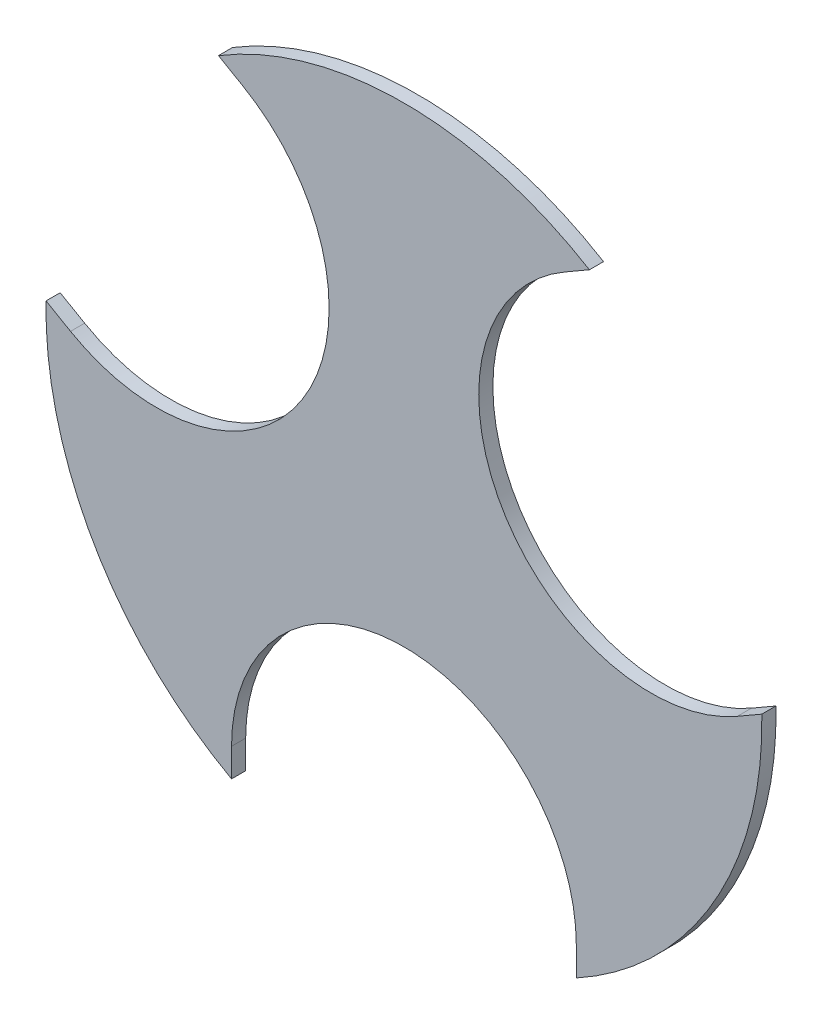
ISO-10303-21;
HEADER;
FILE_DESCRIPTION(('STEP AP214'),'2;1');
FILE_NAME('part.step','',(''),(''),'','','');
FILE_SCHEMA(('AUTOMOTIVE_DESIGN { 1 0 10303 214 1 1 1 1 }'));
ENDSEC;
DATA;
#1=APPLICATION_CONTEXT('core data for automotive mechanical design processes');
#2=APPLICATION_PROTOCOL_DEFINITION('international standard','automotive_design',2000,#1);
#3=PRODUCT_CONTEXT('',#1,'mechanical');
#4=PRODUCT('Part','Part','',(#3));
#5=PRODUCT_RELATED_PRODUCT_CATEGORY('part','',(#4));
#6=PRODUCT_DEFINITION_FORMATION('','',#4);
#7=PRODUCT_DEFINITION_CONTEXT('part definition',#1,'design');
#8=PRODUCT_DEFINITION('design','',#6,#7);
#9=PRODUCT_DEFINITION_SHAPE('','',#8);
#10=(LENGTH_UNIT() NAMED_UNIT(*) SI_UNIT(.MILLI.,.METRE.));
#11=(NAMED_UNIT(*) PLANE_ANGLE_UNIT() SI_UNIT($,.RADIAN.));
#12=(NAMED_UNIT(*) SI_UNIT($,.STERADIAN.) SOLID_ANGLE_UNIT());
#13=UNCERTAINTY_MEASURE_WITH_UNIT(LENGTH_MEASURE(1.E-05),#10,'distance_accuracy_value','');
#14=(GEOMETRIC_REPRESENTATION_CONTEXT(3) GLOBAL_UNCERTAINTY_ASSIGNED_CONTEXT((#13)) GLOBAL_UNIT_ASSIGNED_CONTEXT((#10,
#11,#12)) REPRESENTATION_CONTEXT('',''));
#15=CARTESIAN_POINT('',(0.,0.,0.));
#16=DIRECTION('',(0.,0.,1.));
#17=DIRECTION('',(1.,0.,0.));
#18=AXIS2_PLACEMENT_3D('',#15,#16,#17);
#19=CARTESIAN_POINT('',(0.,0.,5.));
#20=DIRECTION('',(0.,0.,-1.));
#21=DIRECTION('',(-1.,0.,0.));
#22=AXIS2_PLACEMENT_3D('',#19,#20,#21);
#23=CYLINDRICAL_SURFACE('',#22,126.65701717631);
#24=CARTESIAN_POINT('',(0.,0.,0.));
#25=DIRECTION('',(0.,0.,1.));
#26=DIRECTION('',(1.,0.,0.));
#27=AXIS2_PLACEMENT_3D('',#24,#25,#26);
#28=CIRCLE('',#27,126.65701717631);
#29=CARTESIAN_POINT('',(65.6288198200727,108.327549630851,0.));
#30=VERTEX_POINT('',#29);
#31=CARTESIAN_POINT('',(-65.6288198200727,108.327549630851,0.));
#32=VERTEX_POINT('',#31);
#33=EDGE_CURVE('E153',#30,#32,#28,.T.);
#34=ORIENTED_EDGE('',*,*,#33,.T.);
#35=DIRECTION('',(0.,0.,-1.));
#36=VECTOR('',#35,1.);
#37=CARTESIAN_POINT('',(-65.6288198200727,108.327549630851,5.));
#38=LINE('',#37,#36);
#39=CARTESIAN_POINT('',(-65.6288198200727,108.327549630851,5.));
#40=VERTEX_POINT('',#39);
#41=EDGE_CURVE('E11',#40,#32,#38,.T.);
#42=ORIENTED_EDGE('',*,*,#41,.F.);
#43=CARTESIAN_POINT('',(0.,0.,5.));
#44=DIRECTION('',(0.,0.,1.));
#45=DIRECTION('',(1.,0.,0.));
#46=AXIS2_PLACEMENT_3D('',#43,#44,#45);
#47=CIRCLE('',#46,126.65701717631);
#48=CARTESIAN_POINT('',(65.6288198200727,108.327549630851,5.));
#49=VERTEX_POINT('',#48);
#50=EDGE_CURVE('E175',#49,#40,#47,.T.);
#51=ORIENTED_EDGE('',*,*,#50,.F.);
#52=DIRECTION('',(0.,0.,-1.));
#53=VECTOR('',#52,1.);
#54=CARTESIAN_POINT('',(65.6288198200727,108.327549630851,5.));
#55=LINE('',#54,#53);
#56=EDGE_CURVE('E149',#49,#30,#55,.T.);
#57=ORIENTED_EDGE('',*,*,#56,.T.);
#58=EDGE_LOOP('',(#34,#42,#51,#57));
#59=FACE_BOUND('',#58,.T.);
#60=ADVANCED_FACE('F33',(#59),#23,.T.);
#61=CARTESIAN_POINT('',(-65.6288198200727,108.327549630851,5.));
#62=DIRECTION('',(0.5,0.866025403784439,0.));
#63=DIRECTION('',(-0.866025403784439,0.5,0.));
#64=AXIS2_PLACEMENT_3D('',#61,#62,#63);
#65=PLANE('',#64);
#66=DIRECTION('',(0.866025403784439,-0.5,0.));
#67=VECTOR('',#66,1.);
#68=CARTESIAN_POINT('',(-65.6288198200727,108.327549630851,0.));
#69=LINE('',#68,#67);
#70=CARTESIAN_POINT('',(-56.9685657822284,103.327549630851,0.));
#71=VERTEX_POINT('',#70);
#72=EDGE_CURVE('E156',#32,#71,#69,.T.);
#73=ORIENTED_EDGE('',*,*,#72,.T.);
#74=DIRECTION('',(0.,0.,-1.));
#75=VECTOR('',#74,1.);
#76=CARTESIAN_POINT('',(-56.9685657822284,103.327549630851,5.));
#77=LINE('',#76,#75);
#78=CARTESIAN_POINT('',(-56.9685657822284,103.327549630851,5.));
#79=VERTEX_POINT('',#78);
#80=EDGE_CURVE('E41',#79,#71,#77,.T.);
#81=ORIENTED_EDGE('',*,*,#80,.F.);
#82=DIRECTION('',(0.866025403784439,-0.5,0.));
#83=VECTOR('',#82,1.);
#84=CARTESIAN_POINT('',(-65.6288198200727,108.327549630851,5.));
#85=LINE('',#84,#83);
#86=EDGE_CURVE('E104',#40,#79,#85,.T.);
#87=ORIENTED_EDGE('',*,*,#86,.F.);
#88=ORIENTED_EDGE('',*,*,#41,.T.);
#89=EDGE_LOOP('',(#73,#81,#87,#88));
#90=FACE_BOUND('',#89,.T.);
#91=ADVANCED_FACE('F253',(#90),#65,.F.);
#92=CARTESIAN_POINT('',(-87.4685657822283,50.5,5.));
#93=DIRECTION('',(0.,0.,-1.));
#94=DIRECTION('',(-1.,0.,0.));
#95=AXIS2_PLACEMENT_3D('',#92,#93,#94);
#96=CYLINDRICAL_SURFACE('',#95,60.9999999999999);
#97=CARTESIAN_POINT('',(-87.4685657822283,50.5,0.));
#98=DIRECTION('',(0.,0.,-1.));
#99=DIRECTION('',(1.,0.,0.));
#100=AXIS2_PLACEMENT_3D('',#97,#98,#99);
#101=CIRCLE('',#100,60.9999999999999);
#102=CARTESIAN_POINT('',(-117.968565782228,-2.3275496308507,0.));
#103=VERTEX_POINT('',#102);
#104=EDGE_CURVE('E158',#71,#103,#101,.T.);
#105=ORIENTED_EDGE('',*,*,#104,.T.);
#106=DIRECTION('',(0.,0.,-1.));
#107=VECTOR('',#106,1.);
#108=CARTESIAN_POINT('',(-117.968565782228,-2.3275496308507,5.));
#109=LINE('',#108,#107);
#110=CARTESIAN_POINT('',(-117.968565782228,-2.3275496308507,5.));
#111=VERTEX_POINT('',#110);
#112=EDGE_CURVE('E194',#111,#103,#109,.T.);
#113=ORIENTED_EDGE('',*,*,#112,.F.);
#114=CARTESIAN_POINT('',(-87.4685657822283,50.5,5.));
#115=DIRECTION('',(0.,0.,-1.));
#116=DIRECTION('',(1.,0.,0.));
#117=AXIS2_PLACEMENT_3D('',#114,#115,#116);
#118=CIRCLE('',#117,60.9999999999999);
#119=EDGE_CURVE('E202',#79,#111,#118,.T.);
#120=ORIENTED_EDGE('',*,*,#119,.F.);
#121=ORIENTED_EDGE('',*,*,#80,.T.);
#122=EDGE_LOOP('',(#105,#113,#120,#121));
#123=FACE_BOUND('',#122,.T.);
#124=ADVANCED_FACE('F200',(#123),#96,.F.);
#125=CARTESIAN_POINT('',(-126.628819820073,2.67245036914929,5.));
#126=DIRECTION('',(-0.5,-0.866025403784438,0.));
#127=DIRECTION('',(0.866025403784438,-0.500000000000001,0.));
#128=AXIS2_PLACEMENT_3D('',#125,#126,#127);
#129=PLANE('',#128);
#130=DIRECTION('',(-0.866025403784438,0.5,0.));
#131=VECTOR('',#130,1.);
#132=CARTESIAN_POINT('',(-126.628819820073,2.67245036914929,0.));
#133=LINE('',#132,#131);
#134=CARTESIAN_POINT('',(-126.628819820073,2.67245036914929,0.));
#135=VERTEX_POINT('',#134);
#136=EDGE_CURVE('E160',#103,#135,#133,.T.);
#137=ORIENTED_EDGE('',*,*,#136,.T.);
#138=DIRECTION('',(0.,0.,-1.));
#139=VECTOR('',#138,1.);
#140=CARTESIAN_POINT('',(-126.628819820073,2.67245036914929,5.));
#141=LINE('',#140,#139);
#142=CARTESIAN_POINT('',(-126.628819820073,2.67245036914929,5.));
#143=VERTEX_POINT('',#142);
#144=EDGE_CURVE('E191',#143,#135,#141,.T.);
#145=ORIENTED_EDGE('',*,*,#144,.F.);
#146=DIRECTION('',(-0.866025403784438,0.5,0.));
#147=VECTOR('',#146,1.);
#148=CARTESIAN_POINT('',(-126.628819820073,2.67245036914929,5.));
#149=LINE('',#148,#147);
#150=EDGE_CURVE('E220',#111,#143,#149,.T.);
#151=ORIENTED_EDGE('',*,*,#150,.F.);
#152=ORIENTED_EDGE('',*,*,#112,.T.);
#153=EDGE_LOOP('',(#137,#145,#151,#152));
#154=FACE_BOUND('',#153,.T.);
#155=ADVANCED_FACE('F211',(#154),#129,.F.);
#156=CARTESIAN_POINT('',(0.,0.,5.));
#157=DIRECTION('',(0.,0.,-1.));
#158=DIRECTION('',(-1.,0.,0.));
#159=AXIS2_PLACEMENT_3D('',#156,#157,#158);
#160=CYLINDRICAL_SURFACE('',#159,126.65701717631);
#161=CARTESIAN_POINT('',(0.,0.,0.));
#162=DIRECTION('',(0.,0.,1.));
#163=DIRECTION('',(1.,0.,0.));
#164=AXIS2_PLACEMENT_3D('',#161,#162,#163);
#165=CIRCLE('',#164,126.65701717631);
#166=CARTESIAN_POINT('',(-60.9999999999999,-111.,0.));
#167=VERTEX_POINT('',#166);
#168=EDGE_CURVE('E162',#135,#167,#165,.T.);
#169=ORIENTED_EDGE('',*,*,#168,.T.);
#170=DIRECTION('',(0.,0.,-1.));
#171=VECTOR('',#170,1.);
#172=CARTESIAN_POINT('',(-60.9999999999999,-111.,5.));
#173=LINE('',#172,#171);
#174=CARTESIAN_POINT('',(-60.9999999999999,-111.,5.));
#175=VERTEX_POINT('',#174);
#176=EDGE_CURVE('E188',#175,#167,#173,.T.);
#177=ORIENTED_EDGE('',*,*,#176,.F.);
#178=CARTESIAN_POINT('',(0.,0.,5.));
#179=DIRECTION('',(0.,0.,1.));
#180=DIRECTION('',(1.,0.,0.));
#181=AXIS2_PLACEMENT_3D('',#178,#179,#180);
#182=CIRCLE('',#181,126.65701717631);
#183=EDGE_CURVE('E217',#143,#175,#182,.T.);
#184=ORIENTED_EDGE('',*,*,#183,.F.);
#185=ORIENTED_EDGE('',*,*,#144,.T.);
#186=EDGE_LOOP('',(#169,#177,#184,#185));
#187=FACE_BOUND('',#186,.T.);
#188=ADVANCED_FACE('F215',(#187),#160,.T.);
#189=CARTESIAN_POINT('',(-60.9999999999999,-101.,5.));
#190=DIRECTION('',(-1.,0.,0.));
#191=DIRECTION('',(0.,0.,1.));
#192=AXIS2_PLACEMENT_3D('',#189,#190,#191);
#193=PLANE('',#192);
#194=DIRECTION('',(0.,1.,0.));
#195=VECTOR('',#194,1.);
#196=CARTESIAN_POINT('',(-60.9999999999999,-101.,0.));
#197=LINE('',#196,#195);
#198=CARTESIAN_POINT('',(-60.9999999999999,-101.,0.));
#199=VERTEX_POINT('',#198);
#200=EDGE_CURVE('E164',#167,#199,#197,.T.);
#201=ORIENTED_EDGE('',*,*,#200,.T.);
#202=DIRECTION('',(0.,0.,-1.));
#203=VECTOR('',#202,1.);
#204=CARTESIAN_POINT('',(-60.9999999999999,-101.,5.));
#205=LINE('',#204,#203);
#206=CARTESIAN_POINT('',(-60.9999999999999,-101.,5.));
#207=VERTEX_POINT('',#206);
#208=EDGE_CURVE('E185',#207,#199,#205,.T.);
#209=ORIENTED_EDGE('',*,*,#208,.F.);
#210=DIRECTION('',(0.,1.,0.));
#211=VECTOR('',#210,1.);
#212=CARTESIAN_POINT('',(-60.9999999999999,-101.,5.));
#213=LINE('',#212,#211);
#214=EDGE_CURVE('E219',#175,#207,#213,.T.);
#215=ORIENTED_EDGE('',*,*,#214,.F.);
#216=ORIENTED_EDGE('',*,*,#176,.T.);
#217=EDGE_LOOP('',(#201,#209,#215,#216));
#218=FACE_BOUND('',#217,.T.);
#219=ADVANCED_FACE('F266',(#218),#193,.F.);
#220=CARTESIAN_POINT('',(0.,-101.,5.));
#221=DIRECTION('',(0.,0.,-1.));
#222=DIRECTION('',(-1.,0.,0.));
#223=AXIS2_PLACEMENT_3D('',#220,#221,#222);
#224=CYLINDRICAL_SURFACE('',#223,60.9999999999999);
#225=CARTESIAN_POINT('',(0.,-101.,0.));
#226=DIRECTION('',(0.,0.,-1.));
#227=DIRECTION('',(1.,0.,0.));
#228=AXIS2_PLACEMENT_3D('',#225,#226,#227);
#229=CIRCLE('',#228,60.9999999999999);
#230=CARTESIAN_POINT('',(61.,-101.,0.));
#231=VERTEX_POINT('',#230);
#232=EDGE_CURVE('E166',#199,#231,#229,.T.);
#233=ORIENTED_EDGE('',*,*,#232,.T.);
#234=DIRECTION('',(0.,0.,-1.));
#235=VECTOR('',#234,1.);
#236=CARTESIAN_POINT('',(61.,-101.,5.));
#237=LINE('',#236,#235);
#238=CARTESIAN_POINT('',(61.,-101.,5.));
#239=VERTEX_POINT('',#238);
#240=EDGE_CURVE('E182',#239,#231,#237,.T.);
#241=ORIENTED_EDGE('',*,*,#240,.F.);
#242=CARTESIAN_POINT('',(0.,-101.,5.));
#243=DIRECTION('',(0.,0.,-1.));
#244=DIRECTION('',(1.,0.,0.));
#245=AXIS2_PLACEMENT_3D('',#242,#243,#244);
#246=CIRCLE('',#245,60.9999999999999);
#247=EDGE_CURVE('E222',#207,#239,#246,.T.);
#248=ORIENTED_EDGE('',*,*,#247,.F.);
#249=ORIENTED_EDGE('',*,*,#208,.T.);
#250=EDGE_LOOP('',(#233,#241,#248,#249));
#251=FACE_BOUND('',#250,.T.);
#252=ADVANCED_FACE('F269',(#251),#224,.F.);
#253=CARTESIAN_POINT('',(61.,-101.,5.));
#254=DIRECTION('',(1.,0.,0.));
#255=DIRECTION('',(0.,0.,-1.));
#256=AXIS2_PLACEMENT_3D('',#253,#254,#255);
#257=PLANE('',#256);
#258=DIRECTION('',(0.,-1.,0.));
#259=VECTOR('',#258,1.);
#260=CARTESIAN_POINT('',(61.,-101.,0.));
#261=LINE('',#260,#259);
#262=CARTESIAN_POINT('',(61.,-111.,0.));
#263=VERTEX_POINT('',#262);
#264=EDGE_CURVE('E168',#231,#263,#261,.T.);
#265=ORIENTED_EDGE('',*,*,#264,.T.);
#266=DIRECTION('',(0.,0.,-1.));
#267=VECTOR('',#266,1.);
#268=CARTESIAN_POINT('',(61.,-111.,5.));
#269=LINE('',#268,#267);
#270=CARTESIAN_POINT('',(61.,-111.,5.));
#271=VERTEX_POINT('',#270);
#272=EDGE_CURVE('E179',#271,#263,#269,.T.);
#273=ORIENTED_EDGE('',*,*,#272,.F.);
#274=DIRECTION('',(0.,-1.,0.));
#275=VECTOR('',#274,1.);
#276=CARTESIAN_POINT('',(61.,-101.,5.));
#277=LINE('',#276,#275);
#278=EDGE_CURVE('E228',#239,#271,#277,.T.);
#279=ORIENTED_EDGE('',*,*,#278,.F.);
#280=ORIENTED_EDGE('',*,*,#240,.T.);
#281=EDGE_LOOP('',(#265,#273,#279,#280));
#282=FACE_BOUND('',#281,.T.);
#283=ADVANCED_FACE('F234',(#282),#257,.F.);
#284=CARTESIAN_POINT('',(0.,0.,5.));
#285=DIRECTION('',(0.,0.,-1.));
#286=DIRECTION('',(-1.,0.,0.));
#287=AXIS2_PLACEMENT_3D('',#284,#285,#286);
#288=CYLINDRICAL_SURFACE('',#287,126.65701717631);
#289=CARTESIAN_POINT('',(0.,0.,0.));
#290=DIRECTION('',(0.,0.,1.));
#291=DIRECTION('',(1.,0.,0.));
#292=AXIS2_PLACEMENT_3D('',#289,#290,#291);
#293=CIRCLE('',#292,126.65701717631);
#294=CARTESIAN_POINT('',(126.628819820073,2.67245036914926,0.));
#295=VERTEX_POINT('',#294);
#296=EDGE_CURVE('E170',#263,#295,#293,.T.);
#297=ORIENTED_EDGE('',*,*,#296,.T.);
#298=DIRECTION('',(0.,0.,-1.));
#299=VECTOR('',#298,1.);
#300=CARTESIAN_POINT('',(126.628819820073,2.67245036914926,5.));
#301=LINE('',#300,#299);
#302=CARTESIAN_POINT('',(126.628819820073,2.67245036914926,5.));
#303=VERTEX_POINT('',#302);
#304=EDGE_CURVE('E144',#303,#295,#301,.T.);
#305=ORIENTED_EDGE('',*,*,#304,.F.);
#306=CARTESIAN_POINT('',(0.,0.,5.));
#307=DIRECTION('',(0.,0.,1.));
#308=DIRECTION('',(1.,0.,0.));
#309=AXIS2_PLACEMENT_3D('',#306,#307,#308);
#310=CIRCLE('',#309,126.65701717631);
#311=EDGE_CURVE('E135',#271,#303,#310,.T.);
#312=ORIENTED_EDGE('',*,*,#311,.F.);
#313=ORIENTED_EDGE('',*,*,#272,.T.);
#314=EDGE_LOOP('',(#297,#305,#312,#313));
#315=FACE_BOUND('',#314,.T.);
#316=ADVANCED_FACE('F238',(#315),#288,.T.);
#317=CARTESIAN_POINT('',(117.968565782228,-2.32754963085076,5.));
#318=DIRECTION('',(0.500000000000001,-0.866025403784438,0.));
#319=DIRECTION('',(0.866025403784438,0.500000000000001,0.));
#320=AXIS2_PLACEMENT_3D('',#317,#318,#319);
#321=PLANE('',#320);
#322=DIRECTION('',(-0.866025403784438,-0.500000000000001,0.));
#323=VECTOR('',#322,1.);
#324=CARTESIAN_POINT('',(117.968565782228,-2.32754963085076,0.));
#325=LINE('',#324,#323);
#326=CARTESIAN_POINT('',(117.968565782228,-2.32754963085076,0.));
#327=VERTEX_POINT('',#326);
#328=EDGE_CURVE('E143',#295,#327,#325,.T.);
#329=ORIENTED_EDGE('',*,*,#328,.T.);
#330=DIRECTION('',(0.,0.,-1.));
#331=VECTOR('',#330,1.);
#332=CARTESIAN_POINT('',(117.968565782228,-2.32754963085076,5.));
#333=LINE('',#332,#331);
#334=CARTESIAN_POINT('',(117.968565782228,-2.32754963085076,5.));
#335=VERTEX_POINT('',#334);
#336=EDGE_CURVE('E140',#335,#327,#333,.T.);
#337=ORIENTED_EDGE('',*,*,#336,.F.);
#338=DIRECTION('',(-0.866025403784438,-0.500000000000001,0.));
#339=VECTOR('',#338,1.);
#340=CARTESIAN_POINT('',(117.968565782228,-2.32754963085076,5.));
#341=LINE('',#340,#339);
#342=EDGE_CURVE('E129',#303,#335,#341,.T.);
#343=ORIENTED_EDGE('',*,*,#342,.F.);
#344=ORIENTED_EDGE('',*,*,#304,.T.);
#345=EDGE_LOOP('',(#329,#337,#343,#344));
#346=FACE_BOUND('',#345,.T.);
#347=ADVANCED_FACE('F141',(#346),#321,.F.);
#348=CARTESIAN_POINT('',(87.4685657822283,50.5,5.));
#349=DIRECTION('',(0.,0.,-1.));
#350=DIRECTION('',(-1.,0.,0.));
#351=AXIS2_PLACEMENT_3D('',#348,#349,#350);
#352=CYLINDRICAL_SURFACE('',#351,61.);
#353=CARTESIAN_POINT('',(87.4685657822283,50.5,0.));
#354=DIRECTION('',(0.,0.,-1.));
#355=DIRECTION('',(1.,0.,0.));
#356=AXIS2_PLACEMENT_3D('',#353,#354,#355);
#357=CIRCLE('',#356,61.);
#358=CARTESIAN_POINT('',(56.9685657822283,103.327549630851,0.));
#359=VERTEX_POINT('',#358);
#360=EDGE_CURVE('E90',#327,#359,#357,.T.);
#361=ORIENTED_EDGE('',*,*,#360,.T.);
#362=DIRECTION('',(0.,0.,-1.));
#363=VECTOR('',#362,1.);
#364=CARTESIAN_POINT('',(56.9685657822283,103.327549630851,5.));
#365=LINE('',#364,#363);
#366=CARTESIAN_POINT('',(56.9685657822283,103.327549630851,5.));
#367=VERTEX_POINT('',#366);
#368=EDGE_CURVE('E145',#367,#359,#365,.T.);
#369=ORIENTED_EDGE('',*,*,#368,.F.);
#370=CARTESIAN_POINT('',(87.4685657822283,50.5,5.));
#371=DIRECTION('',(0.,0.,-1.));
#372=DIRECTION('',(1.,0.,0.));
#373=AXIS2_PLACEMENT_3D('',#370,#371,#372);
#374=CIRCLE('',#373,61.);
#375=EDGE_CURVE('E133',#335,#367,#374,.T.);
#376=ORIENTED_EDGE('',*,*,#375,.F.);
#377=ORIENTED_EDGE('',*,*,#336,.T.);
#378=EDGE_LOOP('',(#361,#369,#376,#377));
#379=FACE_BOUND('',#378,.T.);
#380=ADVANCED_FACE('F147',(#379),#352,.F.);
#381=CARTESIAN_POINT('',(65.6288198200727,108.327549630851,5.));
#382=DIRECTION('',(-0.499999999999999,0.866025403784439,0.));
#383=DIRECTION('',(-0.866025403784439,-0.499999999999999,0.));
#384=AXIS2_PLACEMENT_3D('',#381,#382,#383);
#385=PLANE('',#384);
#386=DIRECTION('',(0.866025403784439,0.499999999999999,0.));
#387=VECTOR('',#386,1.);
#388=CARTESIAN_POINT('',(65.6288198200727,108.327549630851,0.));
#389=LINE('',#388,#387);
#390=EDGE_CURVE('E96',#359,#30,#389,.T.);
#391=ORIENTED_EDGE('',*,*,#390,.T.);
#392=ORIENTED_EDGE('',*,*,#56,.F.);
#393=DIRECTION('',(0.866025403784439,0.499999999999999,0.));
#394=VECTOR('',#393,1.);
#395=CARTESIAN_POINT('',(65.6288198200727,108.327549630851,5.));
#396=LINE('',#395,#394);
#397=EDGE_CURVE('E49',#367,#49,#396,.T.);
#398=ORIENTED_EDGE('',*,*,#397,.F.);
#399=ORIENTED_EDGE('',*,*,#368,.T.);
#400=EDGE_LOOP('',(#391,#392,#398,#399));
#401=FACE_BOUND('',#400,.T.);
#402=ADVANCED_FACE('F242',(#401),#385,.F.);
#403=CARTESIAN_POINT('',(0.,0.,5.));
#404=DIRECTION('',(0.,0.,1.));
#405=DIRECTION('',(1.,0.,0.));
#406=AXIS2_PLACEMENT_3D('',#403,#404,#405);
#407=PLANE('',#406);
#408=ORIENTED_EDGE('',*,*,#50,.T.);
#409=ORIENTED_EDGE('',*,*,#86,.T.);
#410=ORIENTED_EDGE('',*,*,#119,.T.);
#411=ORIENTED_EDGE('',*,*,#150,.T.);
#412=ORIENTED_EDGE('',*,*,#183,.T.);
#413=ORIENTED_EDGE('',*,*,#214,.T.);
#414=ORIENTED_EDGE('',*,*,#247,.T.);
#415=ORIENTED_EDGE('',*,*,#278,.T.);
#416=ORIENTED_EDGE('',*,*,#311,.T.);
#417=ORIENTED_EDGE('',*,*,#342,.T.);
#418=ORIENTED_EDGE('',*,*,#375,.T.);
#419=ORIENTED_EDGE('',*,*,#397,.T.);
#420=EDGE_LOOP('',(#408,#409,#410,#411,#412,#413,#414,#415,#416,#417,#418,#419));
#421=FACE_BOUND('',#420,.T.);
#422=ADVANCED_FACE('F131',(#421),#407,.T.);
#423=CARTESIAN_POINT('',(0.,0.,0.));
#424=DIRECTION('',(0.,0.,1.));
#425=DIRECTION('',(1.,0.,0.));
#426=AXIS2_PLACEMENT_3D('',#423,#424,#425);
#427=PLANE('',#426);
#428=ORIENTED_EDGE('',*,*,#33,.F.);
#429=ORIENTED_EDGE('',*,*,#390,.F.);
#430=ORIENTED_EDGE('',*,*,#360,.F.);
#431=ORIENTED_EDGE('',*,*,#328,.F.);
#432=ORIENTED_EDGE('',*,*,#296,.F.);
#433=ORIENTED_EDGE('',*,*,#264,.F.);
#434=ORIENTED_EDGE('',*,*,#232,.F.);
#435=ORIENTED_EDGE('',*,*,#200,.F.);
#436=ORIENTED_EDGE('',*,*,#168,.F.);
#437=ORIENTED_EDGE('',*,*,#136,.F.);
#438=ORIENTED_EDGE('',*,*,#104,.F.);
#439=ORIENTED_EDGE('',*,*,#72,.F.);
#440=EDGE_LOOP('',(#428,#429,#430,#431,#432,#433,#434,#435,#436,#437,#438,#439));
#441=FACE_BOUND('',#440,.T.);
#442=ADVANCED_FACE('F206',(#441),#427,.F.);
#443=CLOSED_SHELL('',(#60,#91,#124,#155,#188,#219,#252,#283,#316,#347,#380,#402,#422,#442));
#444=MANIFOLD_SOLID_BREP('B2',#443);
#445=ADVANCED_BREP_SHAPE_REPRESENTATION('',(#18,#444),#14);
#446=SHAPE_DEFINITION_REPRESENTATION(#9,#445);
ENDSEC;
END-ISO-10303-21;
